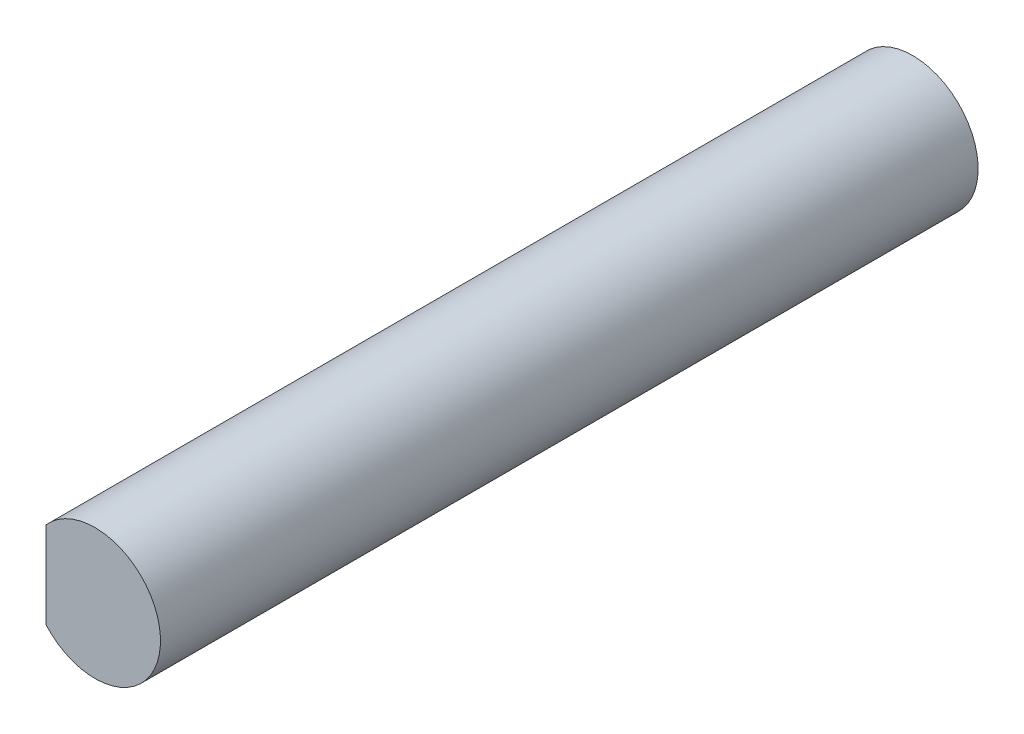
ISO-10303-21;
HEADER;
FILE_DESCRIPTION(('STEP AP214'),'2;1');
FILE_NAME('part.step','',(''),(''),'','','');
FILE_SCHEMA(('AUTOMOTIVE_DESIGN { 1 0 10303 214 1 1 1 1 }'));
ENDSEC;
DATA;
#1=APPLICATION_CONTEXT('core data for automotive mechanical design processes');
#2=APPLICATION_PROTOCOL_DEFINITION('international standard','automotive_design',2000,#1);
#3=PRODUCT_CONTEXT('',#1,'mechanical');
#4=PRODUCT('Part','Part','',(#3));
#5=PRODUCT_RELATED_PRODUCT_CATEGORY('part','',(#4));
#6=PRODUCT_DEFINITION_FORMATION('','',#4);
#7=PRODUCT_DEFINITION_CONTEXT('part definition',#1,'design');
#8=PRODUCT_DEFINITION('design','',#6,#7);
#9=PRODUCT_DEFINITION_SHAPE('','',#8);
#10=(LENGTH_UNIT() NAMED_UNIT(*) SI_UNIT(.MILLI.,.METRE.));
#11=(NAMED_UNIT(*) PLANE_ANGLE_UNIT() SI_UNIT($,.RADIAN.));
#12=(NAMED_UNIT(*) SI_UNIT($,.STERADIAN.) SOLID_ANGLE_UNIT());
#13=UNCERTAINTY_MEASURE_WITH_UNIT(LENGTH_MEASURE(1.E-05),#10,'distance_accuracy_value','');
#14=(GEOMETRIC_REPRESENTATION_CONTEXT(3) GLOBAL_UNCERTAINTY_ASSIGNED_CONTEXT((#13)) GLOBAL_UNIT_ASSIGNED_CONTEXT((#10,
#11,#12)) REPRESENTATION_CONTEXT('',''));
#15=CARTESIAN_POINT('',(0.,0.,0.));
#16=DIRECTION('',(0.,0.,1.));
#17=DIRECTION('',(1.,0.,0.));
#18=AXIS2_PLACEMENT_3D('',#15,#16,#17);
#19=CARTESIAN_POINT('',(0.,0.,25.));
#20=DIRECTION('',(0.,0.,-1.));
#21=DIRECTION('',(-1.,0.,0.));
#22=AXIS2_PLACEMENT_3D('',#19,#20,#21);
#23=CYLINDRICAL_SURFACE('',#22,2.);
#24=CARTESIAN_POINT('',(0.,0.,0.));
#25=DIRECTION('',(0.,0.,1.));
#26=DIRECTION('',(-1.,0.,0.));
#27=AXIS2_PLACEMENT_3D('',#24,#25,#26);
#28=CIRCLE('',#27,2.);
#29=CARTESIAN_POINT('',(-1.5,-1.3228756555323,0.));
#30=VERTEX_POINT('',#29);
#31=CARTESIAN_POINT('',(-1.5,1.3228756555323,0.));
#32=VERTEX_POINT('',#31);
#33=EDGE_CURVE('E67',#30,#32,#28,.T.);
#34=ORIENTED_EDGE('',*,*,#33,.T.);
#35=DIRECTION('',(0.,0.,-1.));
#36=VECTOR('',#35,1.);
#37=CARTESIAN_POINT('',(-1.5,1.3228756555323,25.));
#38=LINE('',#37,#36);
#39=CARTESIAN_POINT('',(-1.5,1.3228756555323,25.));
#40=VERTEX_POINT('',#39);
#41=EDGE_CURVE('E11',#40,#32,#38,.T.);
#42=ORIENTED_EDGE('',*,*,#41,.F.);
#43=CARTESIAN_POINT('',(0.,0.,25.));
#44=DIRECTION('',(0.,0.,1.));
#45=DIRECTION('',(-1.,0.,0.));
#46=AXIS2_PLACEMENT_3D('',#43,#44,#45);
#47=CIRCLE('',#46,2.);
#48=CARTESIAN_POINT('',(-1.5,-1.3228756555323,25.));
#49=VERTEX_POINT('',#48);
#50=EDGE_CURVE('E66',#49,#40,#47,.T.);
#51=ORIENTED_EDGE('',*,*,#50,.F.);
#52=DIRECTION('',(0.,0.,-1.));
#53=VECTOR('',#52,1.);
#54=CARTESIAN_POINT('',(-1.5,-1.3228756555323,25.));
#55=LINE('',#54,#53);
#56=EDGE_CURVE('E44',#49,#30,#55,.T.);
#57=ORIENTED_EDGE('',*,*,#56,.T.);
#58=EDGE_LOOP('',(#34,#42,#51,#57));
#59=FACE_BOUND('',#58,.T.);
#60=ADVANCED_FACE('F36',(#59),#23,.T.);
#61=CARTESIAN_POINT('',(-1.5,1.3228756555323,25.));
#62=DIRECTION('',(1.,0.,0.));
#63=DIRECTION('',(0.,0.,-1.));
#64=AXIS2_PLACEMENT_3D('',#61,#62,#63);
#65=PLANE('',#64);
#66=DIRECTION('',(0.,-1.,0.));
#67=VECTOR('',#66,1.);
#68=CARTESIAN_POINT('',(-1.5,1.3228756555323,0.));
#69=LINE('',#68,#67);
#70=EDGE_CURVE('E59',#32,#30,#69,.T.);
#71=ORIENTED_EDGE('',*,*,#70,.T.);
#72=ORIENTED_EDGE('',*,*,#56,.F.);
#73=DIRECTION('',(0.,-1.,0.));
#74=VECTOR('',#73,1.);
#75=CARTESIAN_POINT('',(-1.5,1.3228756555323,25.));
#76=LINE('',#75,#74);
#77=EDGE_CURVE('E51',#40,#49,#76,.T.);
#78=ORIENTED_EDGE('',*,*,#77,.F.);
#79=ORIENTED_EDGE('',*,*,#41,.T.);
#80=EDGE_LOOP('',(#71,#72,#78,#79));
#81=FACE_BOUND('',#80,.T.);
#82=ADVANCED_FACE('F62',(#81),#65,.F.);
#83=CARTESIAN_POINT('',(0.,0.,25.));
#84=DIRECTION('',(0.,0.,-1.));
#85=DIRECTION('',(-1.,0.,0.));
#86=AXIS2_PLACEMENT_3D('',#83,#84,#85);
#87=PLANE('',#86);
#88=ORIENTED_EDGE('',*,*,#50,.T.);
#89=ORIENTED_EDGE('',*,*,#77,.T.);
#90=EDGE_LOOP('',(#88,#89));
#91=FACE_BOUND('',#90,.T.);
#92=ADVANCED_FACE('F74',(#91),#87,.F.);
#93=CARTESIAN_POINT('',(0.,0.,0.));
#94=DIRECTION('',(0.,0.,-1.));
#95=DIRECTION('',(-1.,0.,0.));
#96=AXIS2_PLACEMENT_3D('',#93,#94,#95);
#97=PLANE('',#96);
#98=ORIENTED_EDGE('',*,*,#33,.F.);
#99=ORIENTED_EDGE('',*,*,#70,.F.);
#100=EDGE_LOOP('',(#98,#99));
#101=FACE_BOUND('',#100,.T.);
#102=ADVANCED_FACE('F70',(#101),#97,.T.);
#103=CLOSED_SHELL('',(#60,#82,#92,#102));
#104=MANIFOLD_SOLID_BREP('B2',#103);
#105=ADVANCED_BREP_SHAPE_REPRESENTATION('',(#18,#104),#14);
#106=SHAPE_DEFINITION_REPRESENTATION(#9,#105);
ENDSEC;
END-ISO-10303-21;
